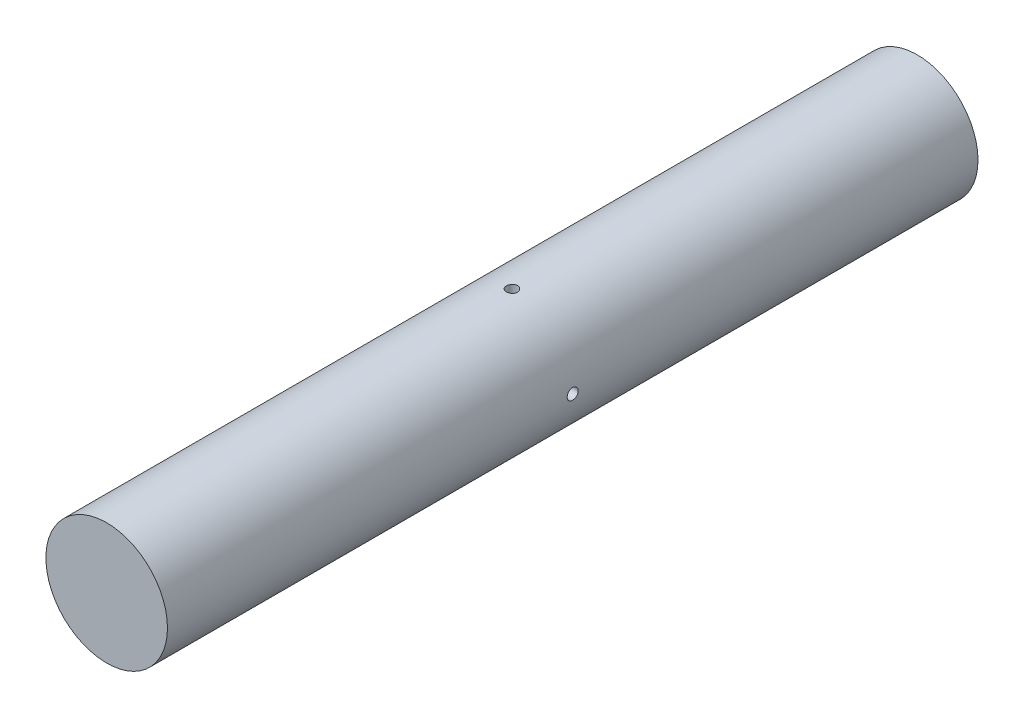
ISO-10303-21;
HEADER;
FILE_DESCRIPTION(('STEP AP214'),'2;1');
FILE_NAME('part.step','',(''),(''),'','','');
FILE_SCHEMA(('AUTOMOTIVE_DESIGN { 1 0 10303 214 1 1 1 1 }'));
ENDSEC;
DATA;
#1=APPLICATION_CONTEXT('core data for automotive mechanical design processes');
#2=APPLICATION_PROTOCOL_DEFINITION('international standard','automotive_design',2000,#1);
#3=PRODUCT_CONTEXT('',#1,'mechanical');
#4=PRODUCT('Part','Part','',(#3));
#5=PRODUCT_RELATED_PRODUCT_CATEGORY('part','',(#4));
#6=PRODUCT_DEFINITION_FORMATION('','',#4);
#7=PRODUCT_DEFINITION_CONTEXT('part definition',#1,'design');
#8=PRODUCT_DEFINITION('design','',#6,#7);
#9=PRODUCT_DEFINITION_SHAPE('','',#8);
#10=(LENGTH_UNIT() NAMED_UNIT(*) SI_UNIT(.MILLI.,.METRE.));
#11=(NAMED_UNIT(*) PLANE_ANGLE_UNIT() SI_UNIT($,.RADIAN.));
#12=(NAMED_UNIT(*) SI_UNIT($,.STERADIAN.) SOLID_ANGLE_UNIT());
#13=UNCERTAINTY_MEASURE_WITH_UNIT(LENGTH_MEASURE(1.E-05),#10,'distance_accuracy_value','');
#14=(GEOMETRIC_REPRESENTATION_CONTEXT(3) GLOBAL_UNCERTAINTY_ASSIGNED_CONTEXT((#13)) GLOBAL_UNIT_ASSIGNED_CONTEXT((#10,
#11,#12)) REPRESENTATION_CONTEXT('',''));
#15=CARTESIAN_POINT('',(0.,0.,0.));
#16=DIRECTION('',(0.,0.,1.));
#17=DIRECTION('',(1.,0.,0.));
#18=AXIS2_PLACEMENT_3D('',#15,#16,#17);
#19=CARTESIAN_POINT('',(0.,0.,250.));
#20=DIRECTION('',(0.,0.,-1.));
#21=DIRECTION('',(-1.,0.,0.));
#22=AXIS2_PLACEMENT_3D('',#19,#20,#21);
#23=CYLINDRICAL_SURFACE('',#22,37.5);
#24=CARTESIAN_POINT('',(-37.5,0.,3.39999999999999));
#25=CARTESIAN_POINT('',(-37.4999979936604,-0.190559723164768,3.39999170540147));
#26=CARTESIAN_POINT('',(-37.4985320160825,-0.381247611908919,3.38392564616794));
#27=CARTESIAN_POINT('',(-37.4928248970775,-0.757342986444866,3.3200740241777));
#28=CARTESIAN_POINT('',(-37.4885806478242,-0.942744315935859,3.27225293879619));
#29=CARTESIAN_POINT('',(-37.4777963886925,-1.30276543085249,3.14628941957584));
#30=CARTESIAN_POINT('',(-37.4712577146716,-1.4773914204712,3.06816462634601));
#31=CARTESIAN_POINT('',(-37.4566169886113,-1.81101129714627,2.88384407369935));
#32=CARTESIAN_POINT('',(-37.4485152612264,-1.9700084200682,2.77765414187147));
#33=CARTESIAN_POINT('',(-37.4316298201157,-2.26837251618839,2.53987604451409));
#34=CARTESIAN_POINT('',(-37.4228443542909,-2.40768629751926,2.40822125216479));
#35=CARTESIAN_POINT('',(-37.405596223706,-2.66227235210449,2.12339206885656));
#36=CARTESIAN_POINT('',(-37.3971335734475,-2.77754354634514,1.97021671258656));
#37=CARTESIAN_POINT('',(-37.3814708573294,-2.98095621962977,1.64636738701624));
#38=CARTESIAN_POINT('',(-37.3742730060971,-3.06905031212188,1.47566353751031));
#39=CARTESIAN_POINT('',(-37.3619757110452,-3.21530548089095,1.1218106715822));
#40=CARTESIAN_POINT('',(-37.356876224013,-3.27346717358699,0.938661911534815));
#41=CARTESIAN_POINT('',(-37.3493683000558,-3.35805067815647,0.565655629196526));
#42=CARTESIAN_POINT('',(-37.3469524542422,-3.38455989016693,0.375818077498897));
#43=CARTESIAN_POINT('',(-37.3450621266294,-3.40535600910841,-0.00562612616709961));
#44=CARTESIAN_POINT('',(-37.3455875804073,-3.39964362178284,-0.197232739296289));
#45=CARTESIAN_POINT('',(-37.3495137334145,-3.35623084372739,-0.576175639251963));
#46=CARTESIAN_POINT('',(-37.3529058781636,-3.31862562307998,-0.76352293008256));
#47=CARTESIAN_POINT('',(-37.3621698121043,-3.21264260375578,-1.12923573101321));
#48=CARTESIAN_POINT('',(-37.3680416294049,-3.14426445624361,-1.30760113927105));
#49=CARTESIAN_POINT('',(-37.3816131526676,-2.97857066105853,-1.65058922091155));
#50=CARTESIAN_POINT('',(-37.3893155398465,-2.88121251336736,-1.81519125260113));
#51=CARTESIAN_POINT('',(-37.405677957123,-2.66035295305759,-2.12575434222956));
#52=CARTESIAN_POINT('',(-37.4143380102238,-2.5368509123969,-2.27171495221947));
#53=CARTESIAN_POINT('',(-37.4316780791412,-2.26667648663798,-2.54140513708923));
#54=CARTESIAN_POINT('',(-37.4403580537721,-2.11992186105973,-2.6650523414482));
#55=CARTESIAN_POINT('',(-37.4567302086562,-1.80769444233155,-2.88596830104053));
#56=CARTESIAN_POINT('',(-37.4644223880785,-1.64222163343756,-2.98323703408644));
#57=CARTESIAN_POINT('',(-37.4779541452752,-1.29719999747569,-3.14863058320942));
#58=CARTESIAN_POINT('',(-37.4837934770168,-1.11764930500238,-3.21675152927851));
#59=CARTESIAN_POINT('',(-37.4929589304417,-0.749594234679229,-3.32185700492957));
#60=CARTESIAN_POINT('',(-37.4962851138796,-0.561090076960226,-3.35884229959777));
#61=CARTESIAN_POINT('',(-37.5000415745191,-0.181192721220264,-3.40052281122428));
#62=CARTESIAN_POINT('',(-37.5004820512895,0.0101879024191318,-3.40533175720285));
#63=CARTESIAN_POINT('',(-37.4984447554869,0.391032525671044,-3.38282131768409));
#64=CARTESIAN_POINT('',(-37.4959670152191,0.580496546477262,-3.35550228784896));
#65=CARTESIAN_POINT('',(-37.4883783880999,0.951803835993014,-3.26960568386892));
#66=CARTESIAN_POINT('',(-37.4832719612077,1.13365945021529,-3.21108104868944));
#67=CARTESIAN_POINT('',(-37.4709992727654,1.48497068650433,-3.06448874274213));
#68=CARTESIAN_POINT('',(-37.4638329729021,1.65442607785588,-2.97642052246445));
#69=CARTESIAN_POINT('',(-37.4482177206628,1.97664281381884,-2.77295674664514));
#70=CARTESIAN_POINT('',(-37.4397652674117,2.12935657436758,-2.65748610720221));
#71=CARTESIAN_POINT('',(-37.4225383699781,2.41327417511859,-2.40260340523529));
#72=CARTESIAN_POINT('',(-37.4137639191713,2.544477572497,-2.26319084995115));
#73=CARTESIAN_POINT('',(-37.3968515560699,2.78204217195323,-1.96388706748412));
#74=CARTESIAN_POINT('',(-37.3887155970567,2.88832898001983,-1.80393666621322));
#75=CARTESIAN_POINT('',(-37.3740299952077,3.07253266468951,-1.46839101491252));
#76=CARTESIAN_POINT('',(-37.3674803340596,3.15044986879774,-1.29279594551745));
#77=CARTESIAN_POINT('',(-37.3567204436657,3.27557674616618,-0.931205409070503));
#78=CARTESIAN_POINT('',(-37.3525067869617,3.32283142588881,-0.745225622498227));
#79=CARTESIAN_POINT('',(-37.3468849024037,3.38543819483055,-0.367931462472979));
#80=CARTESIAN_POINT('',(-37.3454766096231,3.40079102237681,-0.176617212583122));
#81=CARTESIAN_POINT('',(-37.3456260408182,3.39914904180153,0.205175820148668));
#82=CARTESIAN_POINT('',(-37.3471730482269,3.38227110956998,0.395655120686999));
#83=CARTESIAN_POINT('',(-37.3530359694837,3.3168909846451,0.771061312485121));
#84=CARTESIAN_POINT('',(-37.3573518871293,3.26838874858053,0.955988196129672));
#85=CARTESIAN_POINT('',(-37.3682634526361,3.14116756200052,1.31504414655766));
#86=CARTESIAN_POINT('',(-37.3748588985791,3.06245128774545,1.48917416810541));
#87=CARTESIAN_POINT('',(-37.389586767059,2.87704905891663,1.82176763627399));
#88=CARTESIAN_POINT('',(-37.3977191719837,2.77036342484393,1.98023126238748));
#89=CARTESIAN_POINT('',(-37.4146398485466,2.5316114597032,2.27759245041475));
#90=CARTESIAN_POINT('',(-37.4234302995562,2.39945828320324,2.41642016055272));
#91=CARTESIAN_POINT('',(-37.4406566524408,2.11368749589016,2.66998477576932));
#92=CARTESIAN_POINT('',(-37.4490924683881,1.96006472156028,2.78471586886068));
#93=CARTESIAN_POINT('',(-37.4646770938458,1.63536710454836,2.98701439255145));
#94=CARTESIAN_POINT('',(-37.4718231209471,1.46425575021596,3.07452338522869));
#95=CARTESIAN_POINT('',(-37.4839915301108,1.10981695672428,3.21945388171349));
#96=CARTESIAN_POINT('',(-37.4890163325439,0.926503718338989,3.27690969495413));
#97=CARTESIAN_POINT('',(-37.4950975906303,0.618439145091232,3.34559753634575));
#98=CARTESIAN_POINT('',(-37.4969275402536,0.495664227105549,3.36597102926201));
#99=CARTESIAN_POINT('',(-37.4993793975079,0.248611056424633,3.39317494506986));
#100=CARTESIAN_POINT('',(-37.5000013090586,0.124332808608396,3.40000541190295));
#101=CARTESIAN_POINT('',(-37.5,0.,3.39999999999999));
#102=B_SPLINE_CURVE_WITH_KNOTS('',3,(#24,#25,#26,#27,#28,#29,#30,#31,#32,#33,#34,#35,#36,#37,
#38,#39,#40,#41,#42,#43,#44,#45,#46,#47,#48,#49,#50,#51,#52,#53,#54,#55,#56,#57,#58,#59,#60,#61,
#62,#63,#64,#65,#66,#67,#68,#69,#70,#71,#72,#73,#74,#75,#76,#77,#78,#79,#80,#81,#82,#83,#84,#85,
#86,#87,#88,#89,#90,#91,#92,#93,#94,#95,#96,#97,#98,#99,#100,#101),.UNSPECIFIED.,.T.,.F.,(4,2,2,
2,2,2,2,2,2,2,2,2,2,2,2,2,2,2,2,2,2,2,2,2,2,2,2,2,2,2,2,2,2,2,2,2,2,2,4),(0.,0.57122519146037,
1.14309046044219,1.71462332955852,2.28603761577859,2.85896769645853,3.43192348429141,
4.00587271571748,4.57981012692806,5.15215906623599,5.72449546954545,6.29512997252315,
6.8657709442556,7.4372529356633,8.00874865706441,8.58231273768701,9.15587730074412,
9.72951799346375,10.3031445898858,10.8747425965175,11.4463342755211,12.0169593447037,
12.5875950280848,13.159812710094,13.7320421706041,14.3059589873226,14.8798691784049,
15.452935066909,16.0259876923961,16.5969662471126,17.167945584901,17.7388743588798,
18.3097965908686,18.8827012901644,19.455744013011,20.0300085353123,20.6036160246026,
20.9763194566853,21.3490216794983),.UNSPECIFIED.);
#103=CARTESIAN_POINT('',(-37.5,0.,3.39999999999999));
#104=VERTEX_POINT('',#103);
#105=EDGE_CURVE('E11',#104,#104,#102,.T.);
#106=ORIENTED_EDGE('',*,*,#105,.T.);
#107=EDGE_LOOP('',(#106));
#108=FACE_BOUND('',#107,.T.);
#109=CARTESIAN_POINT('',(37.5,0.,-3.39999999999999));
#110=CARTESIAN_POINT('',(37.4999979936604,-0.190559723164768,-3.39999170540147));
#111=CARTESIAN_POINT('',(37.4985320160825,-0.381247611908919,-3.38392564616794));
#112=CARTESIAN_POINT('',(37.4928248970775,-0.757342986444866,-3.3200740241777));
#113=CARTESIAN_POINT('',(37.4885806478242,-0.942744315935859,-3.27225293879619));
#114=CARTESIAN_POINT('',(37.4777963886925,-1.30276543085249,-3.14628941957584));
#115=CARTESIAN_POINT('',(37.4712577146716,-1.4773914204712,-3.06816462634601));
#116=CARTESIAN_POINT('',(37.4566169886113,-1.81101129714627,-2.88384407369935));
#117=CARTESIAN_POINT('',(37.4485152612264,-1.9700084200682,-2.77765414187147));
#118=CARTESIAN_POINT('',(37.4316298201157,-2.26837251618839,-2.53987604451409));
#119=CARTESIAN_POINT('',(37.4228443542909,-2.40768629751926,-2.40822125216479));
#120=CARTESIAN_POINT('',(37.405596223706,-2.66227235210449,-2.12339206885656));
#121=CARTESIAN_POINT('',(37.3971335734475,-2.77754354634514,-1.97021671258656));
#122=CARTESIAN_POINT('',(37.3814708573294,-2.98095621962977,-1.64636738701624));
#123=CARTESIAN_POINT('',(37.3742730060971,-3.06905031212188,-1.47566353751031));
#124=CARTESIAN_POINT('',(37.3619757110452,-3.21530548089095,-1.1218106715822));
#125=CARTESIAN_POINT('',(37.356876224013,-3.27346717358699,-0.938661911534815));
#126=CARTESIAN_POINT('',(37.3493683000558,-3.35805067815647,-0.565655629196526));
#127=CARTESIAN_POINT('',(37.3469524542422,-3.38455989016693,-0.375818077498897));
#128=CARTESIAN_POINT('',(37.3450621266294,-3.40535600910841,0.00562612616709961));
#129=CARTESIAN_POINT('',(37.3455875804073,-3.39964362178284,0.197232739296289));
#130=CARTESIAN_POINT('',(37.3495137334145,-3.35623084372739,0.576175639251963));
#131=CARTESIAN_POINT('',(37.3529058781636,-3.31862562307998,0.76352293008256));
#132=CARTESIAN_POINT('',(37.3621698121043,-3.21264260375578,1.12923573101321));
#133=CARTESIAN_POINT('',(37.3680416294049,-3.14426445624361,1.30760113927105));
#134=CARTESIAN_POINT('',(37.3816131526676,-2.97857066105853,1.65058922091155));
#135=CARTESIAN_POINT('',(37.3893155398465,-2.88121251336736,1.81519125260113));
#136=CARTESIAN_POINT('',(37.405677957123,-2.66035295305759,2.12575434222956));
#137=CARTESIAN_POINT('',(37.4143380102238,-2.5368509123969,2.27171495221947));
#138=CARTESIAN_POINT('',(37.4316780791412,-2.26667648663798,2.54140513708923));
#139=CARTESIAN_POINT('',(37.4403580537721,-2.11992186105973,2.6650523414482));
#140=CARTESIAN_POINT('',(37.4567302086562,-1.80769444233155,2.88596830104053));
#141=CARTESIAN_POINT('',(37.4644223880785,-1.64222163343756,2.98323703408644));
#142=CARTESIAN_POINT('',(37.4779541452752,-1.29719999747569,3.14863058320942));
#143=CARTESIAN_POINT('',(37.4837934770168,-1.11764930500238,3.21675152927851));
#144=CARTESIAN_POINT('',(37.4929589304417,-0.749594234679229,3.32185700492957));
#145=CARTESIAN_POINT('',(37.4962851138796,-0.561090076960226,3.35884229959777));
#146=CARTESIAN_POINT('',(37.5000415745191,-0.181192721220264,3.40052281122428));
#147=CARTESIAN_POINT('',(37.5004820512895,0.0101879024191318,3.40533175720285));
#148=CARTESIAN_POINT('',(37.4984447554869,0.391032525671044,3.38282131768409));
#149=CARTESIAN_POINT('',(37.4959670152191,0.580496546477262,3.35550228784896));
#150=CARTESIAN_POINT('',(37.4883783880999,0.951803835993014,3.26960568386892));
#151=CARTESIAN_POINT('',(37.4832719612077,1.13365945021529,3.21108104868944));
#152=CARTESIAN_POINT('',(37.4709992727654,1.48497068650433,3.06448874274213));
#153=CARTESIAN_POINT('',(37.4638329729021,1.65442607785588,2.97642052246445));
#154=CARTESIAN_POINT('',(37.4482177206628,1.97664281381884,2.77295674664514));
#155=CARTESIAN_POINT('',(37.4397652674117,2.12935657436758,2.65748610720221));
#156=CARTESIAN_POINT('',(37.4225383699781,2.41327417511859,2.40260340523529));
#157=CARTESIAN_POINT('',(37.4137639191713,2.544477572497,2.26319084995115));
#158=CARTESIAN_POINT('',(37.3968515560699,2.78204217195323,1.96388706748412));
#159=CARTESIAN_POINT('',(37.3887155970567,2.88832898001983,1.80393666621322));
#160=CARTESIAN_POINT('',(37.3740299952077,3.07253266468951,1.46839101491252));
#161=CARTESIAN_POINT('',(37.3674803340596,3.15044986879774,1.29279594551745));
#162=CARTESIAN_POINT('',(37.3567204436657,3.27557674616618,0.931205409070503));
#163=CARTESIAN_POINT('',(37.3525067869617,3.32283142588881,0.745225622498227));
#164=CARTESIAN_POINT('',(37.3468849024037,3.38543819483055,0.367931462472979));
#165=CARTESIAN_POINT('',(37.3454766096231,3.40079102237681,0.176617212583122));
#166=CARTESIAN_POINT('',(37.3456260408182,3.39914904180153,-0.205175820148668));
#167=CARTESIAN_POINT('',(37.3471730482269,3.38227110956998,-0.395655120686999));
#168=CARTESIAN_POINT('',(37.3530359694837,3.3168909846451,-0.771061312485121));
#169=CARTESIAN_POINT('',(37.3573518871293,3.26838874858053,-0.955988196129672));
#170=CARTESIAN_POINT('',(37.3682634526361,3.14116756200052,-1.31504414655766));
#171=CARTESIAN_POINT('',(37.3748588985791,3.06245128774545,-1.48917416810541));
#172=CARTESIAN_POINT('',(37.389586767059,2.87704905891663,-1.82176763627399));
#173=CARTESIAN_POINT('',(37.3977191719837,2.77036342484393,-1.98023126238748));
#174=CARTESIAN_POINT('',(37.4146398485466,2.5316114597032,-2.27759245041475));
#175=CARTESIAN_POINT('',(37.4234302995562,2.39945828320324,-2.41642016055272));
#176=CARTESIAN_POINT('',(37.4406566524408,2.11368749589016,-2.66998477576932));
#177=CARTESIAN_POINT('',(37.4490924683881,1.96006472156028,-2.78471586886068));
#178=CARTESIAN_POINT('',(37.4646770938458,1.63536710454836,-2.98701439255145));
#179=CARTESIAN_POINT('',(37.4718231209471,1.46425575021596,-3.07452338522869));
#180=CARTESIAN_POINT('',(37.4839915301108,1.10981695672428,-3.21945388171349));
#181=CARTESIAN_POINT('',(37.4890163325439,0.926503718338989,-3.27690969495413));
#182=CARTESIAN_POINT('',(37.4950975906303,0.618439145091232,-3.34559753634575));
#183=CARTESIAN_POINT('',(37.4969275402536,0.495664227105549,-3.36597102926201));
#184=CARTESIAN_POINT('',(37.4993793975079,0.248611056424633,-3.39317494506986));
#185=CARTESIAN_POINT('',(37.5000013090586,0.124332808608396,-3.40000541190295));
#186=CARTESIAN_POINT('',(37.5,0.,-3.39999999999999));
#187=B_SPLINE_CURVE_WITH_KNOTS('',3,(#109,#110,#111,#112,#113,#114,#115,#116,#117,#118,#119,
#120,#121,#122,#123,#124,#125,#126,#127,#128,#129,#130,#131,#132,#133,#134,#135,#136,#137,#138,
#139,#140,#141,#142,#143,#144,#145,#146,#147,#148,#149,#150,#151,#152,#153,#154,#155,#156,#157,
#158,#159,#160,#161,#162,#163,#164,#165,#166,#167,#168,#169,#170,#171,#172,#173,#174,#175,#176,
#177,#178,#179,#180,#181,#182,#183,#184,#185,#186),.UNSPECIFIED.,.T.,.F.,(4,2,2,2,2,2,2,2,2,2,2,
2,2,2,2,2,2,2,2,2,2,2,2,2,2,2,2,2,2,2,2,2,2,2,2,2,2,2,4),(0.,0.57122519146037,1.14309046044219,
1.71462332955852,2.28603761577859,2.85896769645853,3.43192348429141,4.00587271571748,
4.57981012692806,5.15215906623599,5.72449546954545,6.29512997252315,6.8657709442556,
7.4372529356633,8.00874865706441,8.58231273768701,9.15587730074412,9.72951799346375,
10.3031445898858,10.8747425965175,11.4463342755211,12.0169593447037,12.5875950280848,
13.159812710094,13.7320421706041,14.3059589873226,14.8798691784049,15.452935066909,
16.0259876923961,16.5969662471126,17.167945584901,17.7388743588798,18.3097965908686,
18.8827012901644,19.455744013011,20.0300085353123,20.6036160246026,20.9763194566853,
21.3490216794983),.UNSPECIFIED.);
#188=CARTESIAN_POINT('',(37.5,0.,-3.39999999999999));
#189=VERTEX_POINT('',#188);
#190=EDGE_CURVE('E48',#189,#189,#187,.T.);
#191=ORIENTED_EDGE('',*,*,#190,.T.);
#192=EDGE_LOOP('',(#191));
#193=FACE_BOUND('',#192,.T.);
#194=CARTESIAN_POINT('',(0.,37.5,3.39999999999999));
#195=CARTESIAN_POINT('',(-0.190559723164768,37.4999979936604,3.39999170540147));
#196=CARTESIAN_POINT('',(-0.381247611908919,37.4985320160825,3.38392564616794));
#197=CARTESIAN_POINT('',(-0.757342986444866,37.4928248970775,3.3200740241777));
#198=CARTESIAN_POINT('',(-0.942744315935859,37.4885806478242,3.27225293879619));
#199=CARTESIAN_POINT('',(-1.30276543085249,37.4777963886925,3.14628941957584));
#200=CARTESIAN_POINT('',(-1.4773914204712,37.4712577146716,3.06816462634601));
#201=CARTESIAN_POINT('',(-1.81101129714627,37.4566169886113,2.88384407369935));
#202=CARTESIAN_POINT('',(-1.9700084200682,37.4485152612264,2.77765414187147));
#203=CARTESIAN_POINT('',(-2.26837251618839,37.4316298201157,2.53987604451409));
#204=CARTESIAN_POINT('',(-2.40768629751926,37.4228443542909,2.40822125216479));
#205=CARTESIAN_POINT('',(-2.66227235210449,37.405596223706,2.12339206885656));
#206=CARTESIAN_POINT('',(-2.77754354634514,37.3971335734475,1.97021671258656));
#207=CARTESIAN_POINT('',(-2.98095621962977,37.3814708573294,1.64636738701624));
#208=CARTESIAN_POINT('',(-3.06905031212188,37.3742730060971,1.47566353751031));
#209=CARTESIAN_POINT('',(-3.21530548089095,37.3619757110452,1.1218106715822));
#210=CARTESIAN_POINT('',(-3.27346717358699,37.356876224013,0.938661911534815));
#211=CARTESIAN_POINT('',(-3.35805067815647,37.3493683000558,0.565655629196526));
#212=CARTESIAN_POINT('',(-3.38455989016693,37.3469524542422,0.375818077498897));
#213=CARTESIAN_POINT('',(-3.40535600910841,37.3450621266294,-0.00562612616709961));
#214=CARTESIAN_POINT('',(-3.39964362178284,37.3455875804073,-0.197232739296289));
#215=CARTESIAN_POINT('',(-3.35623084372739,37.3495137334145,-0.576175639251963));
#216=CARTESIAN_POINT('',(-3.31862562307998,37.3529058781636,-0.76352293008256));
#217=CARTESIAN_POINT('',(-3.21264260375578,37.3621698121043,-1.12923573101321));
#218=CARTESIAN_POINT('',(-3.14426445624361,37.3680416294049,-1.30760113927105));
#219=CARTESIAN_POINT('',(-2.97857066105853,37.3816131526676,-1.65058922091155));
#220=CARTESIAN_POINT('',(-2.88121251336736,37.3893155398465,-1.81519125260113));
#221=CARTESIAN_POINT('',(-2.66035295305759,37.405677957123,-2.12575434222956));
#222=CARTESIAN_POINT('',(-2.5368509123969,37.4143380102238,-2.27171495221947));
#223=CARTESIAN_POINT('',(-2.26667648663798,37.4316780791412,-2.54140513708923));
#224=CARTESIAN_POINT('',(-2.11992186105973,37.4403580537721,-2.6650523414482));
#225=CARTESIAN_POINT('',(-1.80769444233155,37.4567302086562,-2.88596830104053));
#226=CARTESIAN_POINT('',(-1.64222163343756,37.4644223880785,-2.98323703408644));
#227=CARTESIAN_POINT('',(-1.29719999747569,37.4779541452752,-3.14863058320942));
#228=CARTESIAN_POINT('',(-1.11764930500238,37.4837934770168,-3.21675152927851));
#229=CARTESIAN_POINT('',(-0.749594234679229,37.4929589304417,-3.32185700492957));
#230=CARTESIAN_POINT('',(-0.561090076960226,37.4962851138796,-3.35884229959777));
#231=CARTESIAN_POINT('',(-0.181192721220264,37.5000415745191,-3.40052281122428));
#232=CARTESIAN_POINT('',(0.0101879024191318,37.5004820512895,-3.40533175720285));
#233=CARTESIAN_POINT('',(0.391032525671044,37.4984447554869,-3.38282131768409));
#234=CARTESIAN_POINT('',(0.580496546477262,37.4959670152191,-3.35550228784896));
#235=CARTESIAN_POINT('',(0.951803835993014,37.4883783880999,-3.26960568386892));
#236=CARTESIAN_POINT('',(1.13365945021529,37.4832719612077,-3.21108104868944));
#237=CARTESIAN_POINT('',(1.48497068650433,37.4709992727654,-3.06448874274213));
#238=CARTESIAN_POINT('',(1.65442607785588,37.4638329729021,-2.97642052246445));
#239=CARTESIAN_POINT('',(1.97664281381884,37.4482177206628,-2.77295674664514));
#240=CARTESIAN_POINT('',(2.12935657436758,37.4397652674117,-2.65748610720221));
#241=CARTESIAN_POINT('',(2.41327417511859,37.4225383699781,-2.40260340523529));
#242=CARTESIAN_POINT('',(2.544477572497,37.4137639191713,-2.26319084995115));
#243=CARTESIAN_POINT('',(2.78204217195323,37.3968515560699,-1.96388706748412));
#244=CARTESIAN_POINT('',(2.88832898001983,37.3887155970567,-1.80393666621322));
#245=CARTESIAN_POINT('',(3.07253266468951,37.3740299952077,-1.46839101491252));
#246=CARTESIAN_POINT('',(3.15044986879774,37.3674803340596,-1.29279594551745));
#247=CARTESIAN_POINT('',(3.27557674616618,37.3567204436657,-0.931205409070503));
#248=CARTESIAN_POINT('',(3.32283142588881,37.3525067869617,-0.745225622498227));
#249=CARTESIAN_POINT('',(3.38543819483055,37.3468849024037,-0.367931462472979));
#250=CARTESIAN_POINT('',(3.40079102237681,37.3454766096231,-0.176617212583122));
#251=CARTESIAN_POINT('',(3.39914904180153,37.3456260408182,0.205175820148668));
#252=CARTESIAN_POINT('',(3.38227110956998,37.3471730482269,0.395655120686999));
#253=CARTESIAN_POINT('',(3.3168909846451,37.3530359694837,0.771061312485121));
#254=CARTESIAN_POINT('',(3.26838874858053,37.3573518871293,0.955988196129672));
#255=CARTESIAN_POINT('',(3.14116756200052,37.3682634526361,1.31504414655766));
#256=CARTESIAN_POINT('',(3.06245128774545,37.3748588985791,1.48917416810541));
#257=CARTESIAN_POINT('',(2.87704905891663,37.389586767059,1.82176763627399));
#258=CARTESIAN_POINT('',(2.77036342484393,37.3977191719837,1.98023126238748));
#259=CARTESIAN_POINT('',(2.5316114597032,37.4146398485466,2.27759245041475));
#260=CARTESIAN_POINT('',(2.39945828320324,37.4234302995562,2.41642016055272));
#261=CARTESIAN_POINT('',(2.11368749589016,37.4406566524408,2.66998477576932));
#262=CARTESIAN_POINT('',(1.96006472156028,37.4490924683881,2.78471586886068));
#263=CARTESIAN_POINT('',(1.63536710454836,37.4646770938458,2.98701439255145));
#264=CARTESIAN_POINT('',(1.46425575021596,37.4718231209471,3.07452338522869));
#265=CARTESIAN_POINT('',(1.10981695672428,37.4839915301108,3.21945388171349));
#266=CARTESIAN_POINT('',(0.926503718338989,37.4890163325439,3.27690969495413));
#267=CARTESIAN_POINT('',(0.618439145091232,37.4950975906303,3.34559753634575));
#268=CARTESIAN_POINT('',(0.495664227105549,37.4969275402536,3.36597102926201));
#269=CARTESIAN_POINT('',(0.248611056424633,37.4993793975079,3.39317494506986));
#270=CARTESIAN_POINT('',(0.124332808608396,37.5000013090586,3.40000541190295));
#271=CARTESIAN_POINT('',(0.,37.5,3.39999999999999));
#272=B_SPLINE_CURVE_WITH_KNOTS('',3,(#194,#195,#196,#197,#198,#199,#200,#201,#202,#203,#204,
#205,#206,#207,#208,#209,#210,#211,#212,#213,#214,#215,#216,#217,#218,#219,#220,#221,#222,#223,
#224,#225,#226,#227,#228,#229,#230,#231,#232,#233,#234,#235,#236,#237,#238,#239,#240,#241,#242,
#243,#244,#245,#246,#247,#248,#249,#250,#251,#252,#253,#254,#255,#256,#257,#258,#259,#260,#261,
#262,#263,#264,#265,#266,#267,#268,#269,#270,#271),.UNSPECIFIED.,.T.,.F.,(4,2,2,2,2,2,2,2,2,2,2,
2,2,2,2,2,2,2,2,2,2,2,2,2,2,2,2,2,2,2,2,2,2,2,2,2,2,2,4),(0.,0.57122519146037,1.14309046044219,
1.71462332955852,2.28603761577859,2.85896769645853,3.43192348429141,4.00587271571748,
4.57981012692806,5.15215906623599,5.72449546954545,6.29512997252315,6.8657709442556,
7.4372529356633,8.00874865706441,8.58231273768701,9.15587730074412,9.72951799346375,
10.3031445898858,10.8747425965175,11.4463342755211,12.0169593447037,12.5875950280848,
13.159812710094,13.7320421706041,14.3059589873226,14.8798691784049,15.452935066909,
16.0259876923961,16.5969662471126,17.167945584901,17.7388743588798,18.3097965908686,
18.8827012901644,19.455744013011,20.0300085353123,20.6036160246026,20.9763194566853,
21.3490216794983),.UNSPECIFIED.);
#273=CARTESIAN_POINT('',(0.,37.5,3.39999999999999));
#274=VERTEX_POINT('',#273);
#275=EDGE_CURVE('E93',#274,#274,#272,.T.);
#276=ORIENTED_EDGE('',*,*,#275,.T.);
#277=EDGE_LOOP('',(#276));
#278=FACE_BOUND('',#277,.T.);
#279=CARTESIAN_POINT('',(0.,-37.5,-3.39999999999999));
#280=CARTESIAN_POINT('',(-0.190559723164768,-37.4999979936604,-3.39999170540147));
#281=CARTESIAN_POINT('',(-0.381247611908919,-37.4985320160825,-3.38392564616794));
#282=CARTESIAN_POINT('',(-0.757342986444866,-37.4928248970775,-3.3200740241777));
#283=CARTESIAN_POINT('',(-0.942744315935859,-37.4885806478242,-3.27225293879619));
#284=CARTESIAN_POINT('',(-1.30276543085249,-37.4777963886925,-3.14628941957584));
#285=CARTESIAN_POINT('',(-1.4773914204712,-37.4712577146716,-3.06816462634601));
#286=CARTESIAN_POINT('',(-1.81101129714627,-37.4566169886113,-2.88384407369935));
#287=CARTESIAN_POINT('',(-1.9700084200682,-37.4485152612264,-2.77765414187147));
#288=CARTESIAN_POINT('',(-2.26837251618839,-37.4316298201157,-2.53987604451409));
#289=CARTESIAN_POINT('',(-2.40768629751926,-37.4228443542909,-2.40822125216479));
#290=CARTESIAN_POINT('',(-2.66227235210449,-37.405596223706,-2.12339206885656));
#291=CARTESIAN_POINT('',(-2.77754354634514,-37.3971335734475,-1.97021671258656));
#292=CARTESIAN_POINT('',(-2.98095621962977,-37.3814708573294,-1.64636738701624));
#293=CARTESIAN_POINT('',(-3.06905031212188,-37.3742730060971,-1.47566353751031));
#294=CARTESIAN_POINT('',(-3.21530548089095,-37.3619757110452,-1.1218106715822));
#295=CARTESIAN_POINT('',(-3.27346717358699,-37.356876224013,-0.938661911534815));
#296=CARTESIAN_POINT('',(-3.35805067815647,-37.3493683000558,-0.565655629196526));
#297=CARTESIAN_POINT('',(-3.38455989016693,-37.3469524542422,-0.375818077498897));
#298=CARTESIAN_POINT('',(-3.40535600910841,-37.3450621266294,0.00562612616709961));
#299=CARTESIAN_POINT('',(-3.39964362178284,-37.3455875804073,0.197232739296289));
#300=CARTESIAN_POINT('',(-3.35623084372739,-37.3495137334145,0.576175639251963));
#301=CARTESIAN_POINT('',(-3.31862562307998,-37.3529058781636,0.76352293008256));
#302=CARTESIAN_POINT('',(-3.21264260375578,-37.3621698121043,1.12923573101321));
#303=CARTESIAN_POINT('',(-3.14426445624361,-37.3680416294049,1.30760113927105));
#304=CARTESIAN_POINT('',(-2.97857066105853,-37.3816131526676,1.65058922091155));
#305=CARTESIAN_POINT('',(-2.88121251336736,-37.3893155398465,1.81519125260113));
#306=CARTESIAN_POINT('',(-2.66035295305759,-37.405677957123,2.12575434222956));
#307=CARTESIAN_POINT('',(-2.5368509123969,-37.4143380102238,2.27171495221947));
#308=CARTESIAN_POINT('',(-2.26667648663798,-37.4316780791412,2.54140513708923));
#309=CARTESIAN_POINT('',(-2.11992186105973,-37.4403580537721,2.6650523414482));
#310=CARTESIAN_POINT('',(-1.80769444233155,-37.4567302086562,2.88596830104053));
#311=CARTESIAN_POINT('',(-1.64222163343756,-37.4644223880785,2.98323703408644));
#312=CARTESIAN_POINT('',(-1.29719999747569,-37.4779541452752,3.14863058320942));
#313=CARTESIAN_POINT('',(-1.11764930500238,-37.4837934770168,3.21675152927851));
#314=CARTESIAN_POINT('',(-0.749594234679229,-37.4929589304417,3.32185700492957));
#315=CARTESIAN_POINT('',(-0.561090076960226,-37.4962851138796,3.35884229959777));
#316=CARTESIAN_POINT('',(-0.181192721220264,-37.5000415745191,3.40052281122428));
#317=CARTESIAN_POINT('',(0.0101879024191318,-37.5004820512895,3.40533175720285));
#318=CARTESIAN_POINT('',(0.391032525671044,-37.4984447554869,3.38282131768409));
#319=CARTESIAN_POINT('',(0.580496546477262,-37.4959670152191,3.35550228784896));
#320=CARTESIAN_POINT('',(0.951803835993014,-37.4883783880999,3.26960568386892));
#321=CARTESIAN_POINT('',(1.13365945021529,-37.4832719612077,3.21108104868944));
#322=CARTESIAN_POINT('',(1.48497068650433,-37.4709992727654,3.06448874274213));
#323=CARTESIAN_POINT('',(1.65442607785588,-37.4638329729021,2.97642052246445));
#324=CARTESIAN_POINT('',(1.97664281381884,-37.4482177206628,2.77295674664514));
#325=CARTESIAN_POINT('',(2.12935657436758,-37.4397652674117,2.65748610720221));
#326=CARTESIAN_POINT('',(2.41327417511859,-37.4225383699781,2.40260340523529));
#327=CARTESIAN_POINT('',(2.544477572497,-37.4137639191713,2.26319084995115));
#328=CARTESIAN_POINT('',(2.78204217195323,-37.3968515560699,1.96388706748412));
#329=CARTESIAN_POINT('',(2.88832898001983,-37.3887155970567,1.80393666621322));
#330=CARTESIAN_POINT('',(3.07253266468951,-37.3740299952077,1.46839101491252));
#331=CARTESIAN_POINT('',(3.15044986879774,-37.3674803340596,1.29279594551745));
#332=CARTESIAN_POINT('',(3.27557674616618,-37.3567204436657,0.931205409070503));
#333=CARTESIAN_POINT('',(3.32283142588881,-37.3525067869617,0.745225622498227));
#334=CARTESIAN_POINT('',(3.38543819483055,-37.3468849024037,0.367931462472979));
#335=CARTESIAN_POINT('',(3.40079102237681,-37.3454766096231,0.176617212583122));
#336=CARTESIAN_POINT('',(3.39914904180153,-37.3456260408182,-0.205175820148668));
#337=CARTESIAN_POINT('',(3.38227110956998,-37.3471730482269,-0.395655120686999));
#338=CARTESIAN_POINT('',(3.3168909846451,-37.3530359694837,-0.771061312485121));
#339=CARTESIAN_POINT('',(3.26838874858053,-37.3573518871293,-0.955988196129672));
#340=CARTESIAN_POINT('',(3.14116756200052,-37.3682634526361,-1.31504414655766));
#341=CARTESIAN_POINT('',(3.06245128774545,-37.3748588985791,-1.48917416810541));
#342=CARTESIAN_POINT('',(2.87704905891663,-37.389586767059,-1.82176763627399));
#343=CARTESIAN_POINT('',(2.77036342484393,-37.3977191719837,-1.98023126238748));
#344=CARTESIAN_POINT('',(2.5316114597032,-37.4146398485466,-2.27759245041475));
#345=CARTESIAN_POINT('',(2.39945828320324,-37.4234302995562,-2.41642016055272));
#346=CARTESIAN_POINT('',(2.11368749589016,-37.4406566524408,-2.66998477576932));
#347=CARTESIAN_POINT('',(1.96006472156028,-37.4490924683881,-2.78471586886068));
#348=CARTESIAN_POINT('',(1.63536710454836,-37.4646770938458,-2.98701439255145));
#349=CARTESIAN_POINT('',(1.46425575021596,-37.4718231209471,-3.07452338522869));
#350=CARTESIAN_POINT('',(1.10981695672428,-37.4839915301108,-3.21945388171349));
#351=CARTESIAN_POINT('',(0.926503718338989,-37.4890163325439,-3.27690969495413));
#352=CARTESIAN_POINT('',(0.618439145091232,-37.4950975906303,-3.34559753634575));
#353=CARTESIAN_POINT('',(0.495664227105549,-37.4969275402536,-3.36597102926201));
#354=CARTESIAN_POINT('',(0.248611056424633,-37.4993793975079,-3.39317494506986));
#355=CARTESIAN_POINT('',(0.124332808608396,-37.5000013090586,-3.40000541190295));
#356=CARTESIAN_POINT('',(0.,-37.5,-3.39999999999999));
#357=B_SPLINE_CURVE_WITH_KNOTS('',3,(#279,#280,#281,#282,#283,#284,#285,#286,#287,#288,#289,
#290,#291,#292,#293,#294,#295,#296,#297,#298,#299,#300,#301,#302,#303,#304,#305,#306,#307,#308,
#309,#310,#311,#312,#313,#314,#315,#316,#317,#318,#319,#320,#321,#322,#323,#324,#325,#326,#327,
#328,#329,#330,#331,#332,#333,#334,#335,#336,#337,#338,#339,#340,#341,#342,#343,#344,#345,#346,
#347,#348,#349,#350,#351,#352,#353,#354,#355,#356),.UNSPECIFIED.,.T.,.F.,(4,2,2,2,2,2,2,2,2,2,2,
2,2,2,2,2,2,2,2,2,2,2,2,2,2,2,2,2,2,2,2,2,2,2,2,2,2,2,4),(0.,0.57122519146037,1.14309046044219,
1.71462332955852,2.28603761577859,2.85896769645853,3.43192348429141,4.00587271571748,
4.57981012692806,5.15215906623599,5.72449546954545,6.29512997252315,6.8657709442556,
7.4372529356633,8.00874865706441,8.58231273768701,9.15587730074412,9.72951799346375,
10.3031445898858,10.8747425965175,11.4463342755211,12.0169593447037,12.5875950280848,
13.159812710094,13.7320421706041,14.3059589873226,14.8798691784049,15.452935066909,
16.0259876923961,16.5969662471126,17.167945584901,17.7388743588798,18.3097965908686,
18.8827012901644,19.455744013011,20.0300085353123,20.6036160246026,20.9763194566853,
21.3490216794983),.UNSPECIFIED.);
#358=CARTESIAN_POINT('',(0.,-37.5,-3.39999999999999));
#359=VERTEX_POINT('',#358);
#360=EDGE_CURVE('E85',#359,#359,#357,.T.);
#361=ORIENTED_EDGE('',*,*,#360,.T.);
#362=EDGE_LOOP('',(#361));
#363=FACE_BOUND('',#362,.T.);
#364=CARTESIAN_POINT('',(0.,0.,250.));
#365=DIRECTION('',(0.,0.,1.));
#366=DIRECTION('',(1.,0.,0.));
#367=AXIS2_PLACEMENT_3D('',#364,#365,#366);
#368=CIRCLE('',#367,37.5);
#369=CARTESIAN_POINT('',(37.5,0.,250.));
#370=VERTEX_POINT('',#369);
#371=EDGE_CURVE('E82',#370,#370,#368,.T.);
#372=ORIENTED_EDGE('',*,*,#371,.F.);
#373=EDGE_LOOP('',(#372));
#374=FACE_BOUND('',#373,.T.);
#375=CARTESIAN_POINT('',(0.,0.,-250.));
#376=DIRECTION('',(0.,0.,1.));
#377=DIRECTION('',(1.,0.,0.));
#378=AXIS2_PLACEMENT_3D('',#375,#376,#377);
#379=CIRCLE('',#378,37.5);
#380=CARTESIAN_POINT('',(37.5,0.,-250.));
#381=VERTEX_POINT('',#380);
#382=EDGE_CURVE('E81',#381,#381,#379,.T.);
#383=ORIENTED_EDGE('',*,*,#382,.T.);
#384=EDGE_LOOP('',(#383));
#385=FACE_BOUND('',#384,.T.);
#386=ADVANCED_FACE('F37',(#108,#193,#278,#363,#374,#385),#23,.T.);
#387=CARTESIAN_POINT('',(0.,0.,250.));
#388=DIRECTION('',(0.,0.,1.));
#389=DIRECTION('',(1.,0.,0.));
#390=AXIS2_PLACEMENT_3D('',#387,#388,#389);
#391=PLANE('',#390);
#392=ORIENTED_EDGE('',*,*,#371,.T.);
#393=EDGE_LOOP('',(#392));
#394=FACE_BOUND('',#393,.T.);
#395=ADVANCED_FACE('F109',(#394),#391,.T.);
#396=CARTESIAN_POINT('',(0.,0.,-250.));
#397=DIRECTION('',(0.,0.,1.));
#398=DIRECTION('',(1.,0.,0.));
#399=AXIS2_PLACEMENT_3D('',#396,#397,#398);
#400=PLANE('',#399);
#401=ORIENTED_EDGE('',*,*,#382,.F.);
#402=EDGE_LOOP('',(#401));
#403=FACE_BOUND('',#402,.T.);
#404=ADVANCED_FACE('F103',(#403),#400,.F.);
#405=CARTESIAN_POINT('',(0.,-37.5,0.));
#406=DIRECTION('',(0.,-1.,0.));
#407=DIRECTION('',(0.,0.,-1.));
#408=AXIS2_PLACEMENT_3D('',#405,#406,#407);
#409=CYLINDRICAL_SURFACE('',#408,3.39999999999999);
#410=CARTESIAN_POINT('',(0.,-16.25,0.));
#411=DIRECTION('',(0.,-1.,0.));
#412=DIRECTION('',(0.,0.,-1.));
#413=AXIS2_PLACEMENT_3D('',#410,#411,#412);
#414=CIRCLE('',#413,3.39999999999999);
#415=CARTESIAN_POINT('',(0.,-16.25,-3.39999999999999));
#416=VERTEX_POINT('',#415);
#417=EDGE_CURVE('E78',#416,#416,#414,.T.);
#418=ORIENTED_EDGE('',*,*,#417,.F.);
#419=EDGE_LOOP('',(#418));
#420=FACE_BOUND('',#419,.T.);
#421=ORIENTED_EDGE('',*,*,#360,.F.);
#422=EDGE_LOOP('',(#421));
#423=FACE_BOUND('',#422,.T.);
#424=ADVANCED_FACE('F97',(#420,#423),#409,.F.);
#425=CARTESIAN_POINT('',(0.,-16.25,0.));
#426=DIRECTION('',(0.,-1.,0.));
#427=DIRECTION('',(0.,0.,-1.));
#428=AXIS2_PLACEMENT_3D('',#425,#426,#427);
#429=CONICAL_SURFACE('',#428,3.39999999999999,1.02974425867665);
#430=CARTESIAN_POINT('',(0.,-14.2070738953063,0.));
#431=VERTEX_POINT('',#430);
#432=VERTEX_LOOP('',#431);
#433=FACE_BOUND('',#432,.T.);
#434=ORIENTED_EDGE('',*,*,#417,.T.);
#435=EDGE_LOOP('',(#434));
#436=FACE_BOUND('',#435,.T.);
#437=ADVANCED_FACE('F102',(#433,#436),#429,.F.);
#438=CARTESIAN_POINT('',(0.,37.5,0.));
#439=DIRECTION('',(0.,1.,0.));
#440=DIRECTION('',(0.,0.,1.));
#441=AXIS2_PLACEMENT_3D('',#438,#439,#440);
#442=CYLINDRICAL_SURFACE('',#441,3.39999999999999);
#443=CARTESIAN_POINT('',(0.,16.25,0.));
#444=DIRECTION('',(0.,1.,0.));
#445=DIRECTION('',(0.,0.,1.));
#446=AXIS2_PLACEMENT_3D('',#443,#444,#445);
#447=CIRCLE('',#446,3.39999999999999);
#448=CARTESIAN_POINT('',(0.,16.25,3.39999999999999));
#449=VERTEX_POINT('',#448);
#450=EDGE_CURVE('E73',#449,#449,#447,.T.);
#451=ORIENTED_EDGE('',*,*,#450,.F.);
#452=EDGE_LOOP('',(#451));
#453=FACE_BOUND('',#452,.T.);
#454=ORIENTED_EDGE('',*,*,#275,.F.);
#455=EDGE_LOOP('',(#454));
#456=FACE_BOUND('',#455,.T.);
#457=ADVANCED_FACE('F108',(#453,#456),#442,.F.);
#458=CARTESIAN_POINT('',(0.,16.25,0.));
#459=DIRECTION('',(0.,1.,0.));
#460=DIRECTION('',(0.,0.,1.));
#461=AXIS2_PLACEMENT_3D('',#458,#459,#460);
#462=CONICAL_SURFACE('',#461,3.39999999999999,1.02974425867665);
#463=CARTESIAN_POINT('',(0.,14.2070738953063,0.));
#464=VERTEX_POINT('',#463);
#465=VERTEX_LOOP('',#464);
#466=FACE_BOUND('',#465,.T.);
#467=ORIENTED_EDGE('',*,*,#450,.T.);
#468=EDGE_LOOP('',(#467));
#469=FACE_BOUND('',#468,.T.);
#470=ADVANCED_FACE('F105',(#466,#469),#462,.F.);
#471=CARTESIAN_POINT('',(37.5,0.,0.));
#472=DIRECTION('',(1.,0.,0.));
#473=DIRECTION('',(0.,0.,-1.));
#474=AXIS2_PLACEMENT_3D('',#471,#472,#473);
#475=CYLINDRICAL_SURFACE('',#474,3.39999999999999);
#476=CARTESIAN_POINT('',(16.25,0.,0.));
#477=DIRECTION('',(1.,0.,0.));
#478=DIRECTION('',(0.,0.,-1.));
#479=AXIS2_PLACEMENT_3D('',#476,#477,#478);
#480=CIRCLE('',#479,3.39999999999999);
#481=CARTESIAN_POINT('',(16.25,0.,-3.39999999999999));
#482=VERTEX_POINT('',#481);
#483=EDGE_CURVE('E70',#482,#482,#480,.T.);
#484=ORIENTED_EDGE('',*,*,#483,.F.);
#485=EDGE_LOOP('',(#484));
#486=FACE_BOUND('',#485,.T.);
#487=ORIENTED_EDGE('',*,*,#190,.F.);
#488=EDGE_LOOP('',(#487));
#489=FACE_BOUND('',#488,.T.);
#490=ADVANCED_FACE('F138',(#486,#489),#475,.F.);
#491=CARTESIAN_POINT('',(16.25,0.,0.));
#492=DIRECTION('',(1.,0.,0.));
#493=DIRECTION('',(0.,0.,-1.));
#494=AXIS2_PLACEMENT_3D('',#491,#492,#493);
#495=CONICAL_SURFACE('',#494,3.39999999999999,1.02974425867665);
#496=CARTESIAN_POINT('',(14.2070738953063,0.,0.));
#497=VERTEX_POINT('',#496);
#498=VERTEX_LOOP('',#497);
#499=FACE_BOUND('',#498,.T.);
#500=ORIENTED_EDGE('',*,*,#483,.T.);
#501=EDGE_LOOP('',(#500));
#502=FACE_BOUND('',#501,.T.);
#503=ADVANCED_FACE('F142',(#499,#502),#495,.F.);
#504=CARTESIAN_POINT('',(-37.5,0.,0.));
#505=DIRECTION('',(-1.,0.,0.));
#506=DIRECTION('',(0.,0.,1.));
#507=AXIS2_PLACEMENT_3D('',#504,#505,#506);
#508=CYLINDRICAL_SURFACE('',#507,3.39999999999999);
#509=CARTESIAN_POINT('',(-16.25,0.,0.));
#510=DIRECTION('',(-1.,0.,0.));
#511=DIRECTION('',(0.,0.,1.));
#512=AXIS2_PLACEMENT_3D('',#509,#510,#511);
#513=CIRCLE('',#512,3.39999999999999);
#514=CARTESIAN_POINT('',(-16.25,0.,3.39999999999999));
#515=VERTEX_POINT('',#514);
#516=EDGE_CURVE('E68',#515,#515,#513,.T.);
#517=ORIENTED_EDGE('',*,*,#516,.F.);
#518=EDGE_LOOP('',(#517));
#519=FACE_BOUND('',#518,.T.);
#520=ORIENTED_EDGE('',*,*,#105,.F.);
#521=EDGE_LOOP('',(#520));
#522=FACE_BOUND('',#521,.T.);
#523=ADVANCED_FACE('F64',(#519,#522),#508,.F.);
#524=CARTESIAN_POINT('',(-16.25,0.,0.));
#525=DIRECTION('',(-1.,0.,0.));
#526=DIRECTION('',(0.,0.,1.));
#527=AXIS2_PLACEMENT_3D('',#524,#525,#526);
#528=CONICAL_SURFACE('',#527,3.39999999999999,1.02974425867665);
#529=CARTESIAN_POINT('',(-14.2070738953063,0.,0.));
#530=VERTEX_POINT('',#529);
#531=VERTEX_LOOP('',#530);
#532=FACE_BOUND('',#531,.T.);
#533=ORIENTED_EDGE('',*,*,#516,.T.);
#534=EDGE_LOOP('',(#533));
#535=FACE_BOUND('',#534,.T.);
#536=ADVANCED_FACE('F61',(#532,#535),#528,.F.);
#537=CLOSED_SHELL('',(#386,#395,#404,#424,#437,#457,#470,#490,#503,#523,#536));
#538=MANIFOLD_SOLID_BREP('B2',#537);
#539=ADVANCED_BREP_SHAPE_REPRESENTATION('',(#18,#538),#14);
#540=SHAPE_DEFINITION_REPRESENTATION(#9,#539);
ENDSEC;
END-ISO-10303-21;
